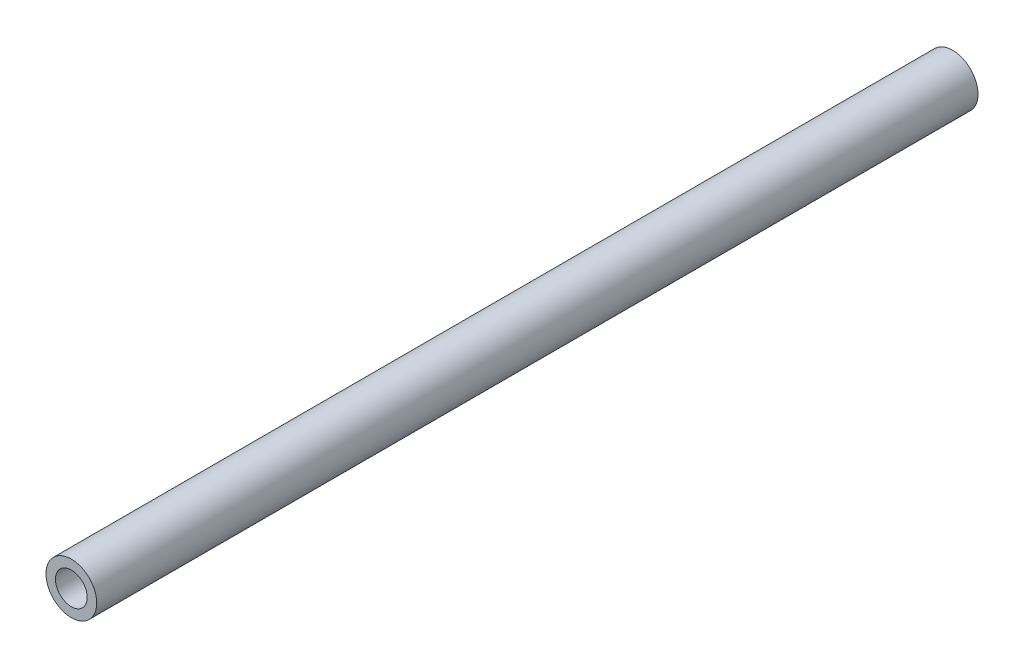
ISO-10303-21;
HEADER;
FILE_DESCRIPTION(('STEP AP214'),'2;1');
FILE_NAME('part.step','',(''),(''),'','','');
FILE_SCHEMA(('AUTOMOTIVE_DESIGN { 1 0 10303 214 1 1 1 1 }'));
ENDSEC;
DATA;
#1=APPLICATION_CONTEXT('core data for automotive mechanical design processes');
#2=APPLICATION_PROTOCOL_DEFINITION('international standard','automotive_design',2000,#1);
#3=PRODUCT_CONTEXT('',#1,'mechanical');
#4=PRODUCT('Part','Part','',(#3));
#5=PRODUCT_RELATED_PRODUCT_CATEGORY('part','',(#4));
#6=PRODUCT_DEFINITION_FORMATION('','',#4);
#7=PRODUCT_DEFINITION_CONTEXT('part definition',#1,'design');
#8=PRODUCT_DEFINITION('design','',#6,#7);
#9=PRODUCT_DEFINITION_SHAPE('','',#8);
#10=(LENGTH_UNIT() NAMED_UNIT(*) SI_UNIT(.MILLI.,.METRE.));
#11=(NAMED_UNIT(*) PLANE_ANGLE_UNIT() SI_UNIT($,.RADIAN.));
#12=(NAMED_UNIT(*) SI_UNIT($,.STERADIAN.) SOLID_ANGLE_UNIT());
#13=UNCERTAINTY_MEASURE_WITH_UNIT(LENGTH_MEASURE(1.E-05),#10,'distance_accuracy_value','');
#14=(GEOMETRIC_REPRESENTATION_CONTEXT(3) GLOBAL_UNCERTAINTY_ASSIGNED_CONTEXT((#13)) GLOBAL_UNIT_ASSIGNED_CONTEXT((#10,
#11,#12)) REPRESENTATION_CONTEXT('',''));
#15=CARTESIAN_POINT('',(0.,0.,0.));
#16=DIRECTION('',(0.,0.,1.));
#17=DIRECTION('',(1.,0.,0.));
#18=AXIS2_PLACEMENT_3D('',#15,#16,#17);
#19=CARTESIAN_POINT('',(0.,0.,-296.85));
#20=DIRECTION('',(0.,0.,1.));
#21=DIRECTION('',(1.,0.,0.));
#22=AXIS2_PLACEMENT_3D('',#19,#20,#21);
#23=CYLINDRICAL_SURFACE('',#22,8.55);
#24=CARTESIAN_POINT('',(0.,0.,-296.85));
#25=DIRECTION('',(0.,0.,1.));
#26=DIRECTION('',(1.,0.,0.));
#27=AXIS2_PLACEMENT_3D('',#24,#25,#26);
#28=CIRCLE('',#27,8.55);
#29=CARTESIAN_POINT('',(8.55,0.,-296.85));
#30=VERTEX_POINT('',#29);
#31=EDGE_CURVE('E10',#30,#30,#28,.T.);
#32=ORIENTED_EDGE('',*,*,#31,.T.);
#33=EDGE_LOOP('',(#32));
#34=FACE_BOUND('',#33,.T.);
#35=CARTESIAN_POINT('',(0.,0.,0.));
#36=DIRECTION('',(0.,0.,1.));
#37=DIRECTION('',(1.,0.,0.));
#38=AXIS2_PLACEMENT_3D('',#35,#36,#37);
#39=CIRCLE('',#38,8.55);
#40=CARTESIAN_POINT('',(8.55,0.,0.));
#41=VERTEX_POINT('',#40);
#42=EDGE_CURVE('E35',#41,#41,#39,.T.);
#43=ORIENTED_EDGE('',*,*,#42,.F.);
#44=EDGE_LOOP('',(#43));
#45=FACE_BOUND('',#44,.T.);
#46=ADVANCED_FACE('F32',(#34,#45),#23,.T.);
#47=CARTESIAN_POINT('',(0.,0.,-296.85));
#48=DIRECTION('',(0.,0.,1.));
#49=DIRECTION('',(1.,0.,0.));
#50=AXIS2_PLACEMENT_3D('',#47,#48,#49);
#51=PLANE('',#50);
#52=CARTESIAN_POINT('',(0.,0.,-296.85));
#53=DIRECTION('',(0.,0.,1.));
#54=DIRECTION('',(1.,0.,0.));
#55=AXIS2_PLACEMENT_3D('',#52,#53,#54);
#56=CIRCLE('',#55,5.35);
#57=CARTESIAN_POINT('',(5.35,0.,-296.85));
#58=VERTEX_POINT('',#57);
#59=EDGE_CURVE('E42',#58,#58,#56,.T.);
#60=ORIENTED_EDGE('',*,*,#59,.T.);
#61=EDGE_LOOP('',(#60));
#62=FACE_BOUND('',#61,.T.);
#63=ORIENTED_EDGE('',*,*,#31,.F.);
#64=EDGE_LOOP('',(#63));
#65=FACE_BOUND('',#64,.T.);
#66=ADVANCED_FACE('F50',(#62,#65),#51,.F.);
#67=CARTESIAN_POINT('',(0.,0.,0.));
#68=DIRECTION('',(0.,0.,1.));
#69=DIRECTION('',(1.,0.,0.));
#70=AXIS2_PLACEMENT_3D('',#67,#68,#69);
#71=PLANE('',#70);
#72=CARTESIAN_POINT('',(0.,0.,0.));
#73=DIRECTION('',(0.,0.,1.));
#74=DIRECTION('',(1.,0.,0.));
#75=AXIS2_PLACEMENT_3D('',#72,#73,#74);
#76=CIRCLE('',#75,5.35);
#77=CARTESIAN_POINT('',(5.35,0.,0.));
#78=VERTEX_POINT('',#77);
#79=EDGE_CURVE('E44',#78,#78,#76,.T.);
#80=ORIENTED_EDGE('',*,*,#79,.F.);
#81=EDGE_LOOP('',(#80));
#82=FACE_BOUND('',#81,.T.);
#83=ORIENTED_EDGE('',*,*,#42,.T.);
#84=EDGE_LOOP('',(#83));
#85=FACE_BOUND('',#84,.T.);
#86=ADVANCED_FACE('F56',(#82,#85),#71,.T.);
#87=CARTESIAN_POINT('',(0.,0.,-296.85));
#88=DIRECTION('',(0.,0.,1.));
#89=DIRECTION('',(1.,0.,0.));
#90=AXIS2_PLACEMENT_3D('',#87,#88,#89);
#91=CYLINDRICAL_SURFACE('',#90,5.35);
#92=ORIENTED_EDGE('',*,*,#59,.F.);
#93=EDGE_LOOP('',(#92));
#94=FACE_BOUND('',#93,.T.);
#95=ORIENTED_EDGE('',*,*,#79,.T.);
#96=EDGE_LOOP('',(#95));
#97=FACE_BOUND('',#96,.T.);
#98=ADVANCED_FACE('F53',(#94,#97),#91,.F.);
#99=CLOSED_SHELL('',(#46,#66,#86,#98));
#100=MANIFOLD_SOLID_BREP('B2',#99);
#101=ADVANCED_BREP_SHAPE_REPRESENTATION('',(#18,#100),#14);
#102=SHAPE_DEFINITION_REPRESENTATION(#9,#101);
ENDSEC;
END-ISO-10303-21;
